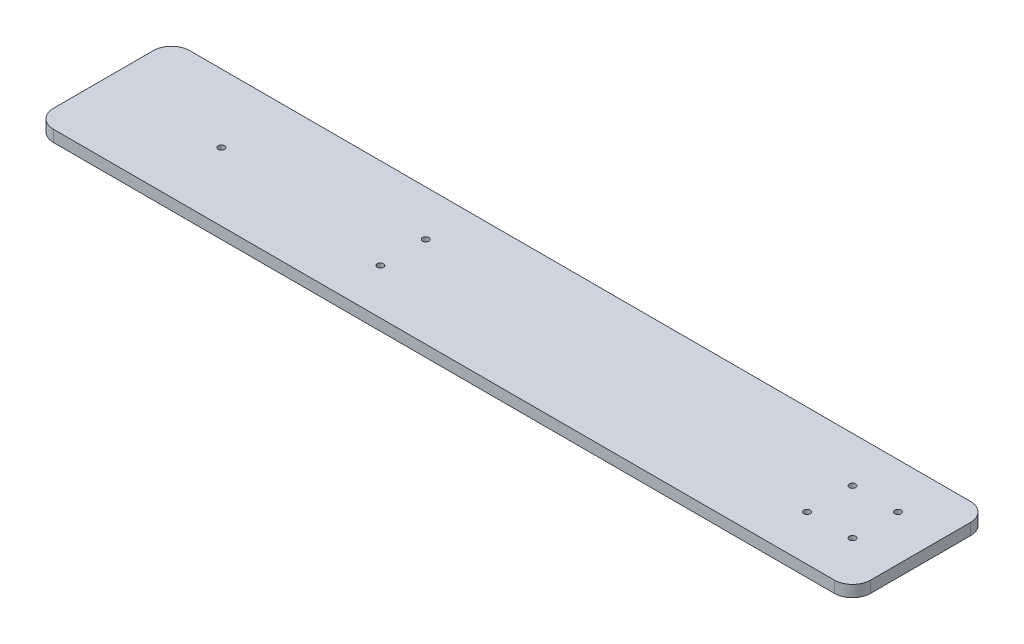
ISO-10303-21;
HEADER;
FILE_DESCRIPTION(('STEP AP214'),'2;1');
FILE_NAME('part.step','',(''),(''),'','','');
FILE_SCHEMA(('AUTOMOTIVE_DESIGN { 1 0 10303 214 1 1 1 1 }'));
ENDSEC;
DATA;
#1=APPLICATION_CONTEXT('core data for automotive mechanical design processes');
#2=APPLICATION_PROTOCOL_DEFINITION('international standard','automotive_design',2000,#1);
#3=PRODUCT_CONTEXT('',#1,'mechanical');
#4=PRODUCT('Part','Part','',(#3));
#5=PRODUCT_RELATED_PRODUCT_CATEGORY('part','',(#4));
#6=PRODUCT_DEFINITION_FORMATION('','',#4);
#7=PRODUCT_DEFINITION_CONTEXT('part definition',#1,'design');
#8=PRODUCT_DEFINITION('design','',#6,#7);
#9=PRODUCT_DEFINITION_SHAPE('','',#8);
#10=(LENGTH_UNIT() NAMED_UNIT(*) SI_UNIT(.MILLI.,.METRE.));
#11=(NAMED_UNIT(*) PLANE_ANGLE_UNIT() SI_UNIT($,.RADIAN.));
#12=(NAMED_UNIT(*) SI_UNIT($,.STERADIAN.) SOLID_ANGLE_UNIT());
#13=UNCERTAINTY_MEASURE_WITH_UNIT(LENGTH_MEASURE(1.E-05),#10,'distance_accuracy_value','');
#14=(GEOMETRIC_REPRESENTATION_CONTEXT(3) GLOBAL_UNCERTAINTY_ASSIGNED_CONTEXT((#13)) GLOBAL_UNIT_ASSIGNED_CONTEXT((#10,
#11,#12)) REPRESENTATION_CONTEXT('',''));
#15=CARTESIAN_POINT('',(0.,0.,0.));
#16=DIRECTION('',(0.,0.,1.));
#17=DIRECTION('',(1.,0.,0.));
#18=AXIS2_PLACEMENT_3D('',#15,#16,#17);
#19=CARTESIAN_POINT('',(225.,6.35,-37.5));
#20=DIRECTION('',(-1.,0.,0.));
#21=DIRECTION('',(0.,0.,1.));
#22=AXIS2_PLACEMENT_3D('',#19,#20,#21);
#23=PLANE('',#22);
#24=DIRECTION('',(0.,0.,-1.));
#25=VECTOR('',#24,1.);
#26=CARTESIAN_POINT('',(225.,0.,-37.5));
#27=LINE('',#26,#25);
#28=CARTESIAN_POINT('',(225.,0.,27.5));
#29=VERTEX_POINT('',#28);
#30=CARTESIAN_POINT('',(225.,0.,-27.5));
#31=VERTEX_POINT('',#30);
#32=EDGE_CURVE('E128',#29,#31,#27,.T.);
#33=ORIENTED_EDGE('',*,*,#32,.T.);
#34=DIRECTION('',(0.,-1.,0.));
#35=VECTOR('',#34,1.);
#36=CARTESIAN_POINT('',(225.,6.35,-27.5));
#37=LINE('',#36,#35);
#38=CARTESIAN_POINT('',(225.,6.35,-27.5));
#39=VERTEX_POINT('',#38);
#40=EDGE_CURVE('E106',#31,#39,#37,.F.);
#41=ORIENTED_EDGE('',*,*,#40,.T.);
#42=DIRECTION('',(0.,0.,-1.));
#43=VECTOR('',#42,1.);
#44=CARTESIAN_POINT('',(225.,6.35,-37.5));
#45=LINE('',#44,#43);
#46=CARTESIAN_POINT('',(225.,6.35,27.5));
#47=VERTEX_POINT('',#46);
#48=EDGE_CURVE('E138',#47,#39,#45,.T.);
#49=ORIENTED_EDGE('',*,*,#48,.F.);
#50=DIRECTION('',(0.,-1.,0.));
#51=VECTOR('',#50,1.);
#52=CARTESIAN_POINT('',(225.,6.35,27.5));
#53=LINE('',#52,#51);
#54=EDGE_CURVE('E111',#47,#29,#53,.T.);
#55=ORIENTED_EDGE('',*,*,#54,.T.);
#56=EDGE_LOOP('',(#33,#41,#49,#55));
#57=FACE_BOUND('',#56,.T.);
#58=ADVANCED_FACE('F35',(#57),#23,.F.);
#59=CARTESIAN_POINT('',(-225.,6.35,-37.5));
#60=DIRECTION('',(0.,0.,1.));
#61=DIRECTION('',(1.,0.,0.));
#62=AXIS2_PLACEMENT_3D('',#59,#60,#61);
#63=PLANE('',#62);
#64=DIRECTION('',(-1.,0.,0.));
#65=VECTOR('',#64,1.);
#66=CARTESIAN_POINT('',(-225.,6.35,-37.5));
#67=LINE('',#66,#65);
#68=CARTESIAN_POINT('',(215.,6.35,-37.5));
#69=VERTEX_POINT('',#68);
#70=CARTESIAN_POINT('',(-215.,6.35,-37.5));
#71=VERTEX_POINT('',#70);
#72=EDGE_CURVE('E121',#69,#71,#67,.T.);
#73=ORIENTED_EDGE('',*,*,#72,.F.);
#74=DIRECTION('',(0.,-1.,0.));
#75=VECTOR('',#74,1.);
#76=CARTESIAN_POINT('',(215.,6.35,-37.5));
#77=LINE('',#76,#75);
#78=CARTESIAN_POINT('',(215.,0.,-37.5));
#79=VERTEX_POINT('',#78);
#80=EDGE_CURVE('E105',#69,#79,#77,.T.);
#81=ORIENTED_EDGE('',*,*,#80,.T.);
#82=DIRECTION('',(-1.,0.,0.));
#83=VECTOR('',#82,1.);
#84=CARTESIAN_POINT('',(-225.,0.,-37.5));
#85=LINE('',#84,#83);
#86=CARTESIAN_POINT('',(-215.,0.,-37.5));
#87=VERTEX_POINT('',#86);
#88=EDGE_CURVE('E118',#79,#87,#85,.T.);
#89=ORIENTED_EDGE('',*,*,#88,.T.);
#90=DIRECTION('',(0.,-1.,0.));
#91=VECTOR('',#90,1.);
#92=CARTESIAN_POINT('',(-215.,6.35,-37.5));
#93=LINE('',#92,#91);
#94=EDGE_CURVE('E123',#87,#71,#93,.F.);
#95=ORIENTED_EDGE('',*,*,#94,.T.);
#96=EDGE_LOOP('',(#73,#81,#89,#95));
#97=FACE_BOUND('',#96,.T.);
#98=ADVANCED_FACE('F117',(#97),#63,.F.);
#99=CARTESIAN_POINT('',(-225.,6.35,-37.5));
#100=DIRECTION('',(1.,0.,0.));
#101=DIRECTION('',(0.,0.,-1.));
#102=AXIS2_PLACEMENT_3D('',#99,#100,#101);
#103=PLANE('',#102);
#104=DIRECTION('',(0.,0.,1.));
#105=VECTOR('',#104,1.);
#106=CARTESIAN_POINT('',(-225.,0.,-37.5));
#107=LINE('',#106,#105);
#108=CARTESIAN_POINT('',(-225.,0.,-27.5));
#109=VERTEX_POINT('',#108);
#110=CARTESIAN_POINT('',(-225.,0.,27.5));
#111=VERTEX_POINT('',#110);
#112=EDGE_CURVE('E127',#109,#111,#107,.T.);
#113=ORIENTED_EDGE('',*,*,#112,.T.);
#114=DIRECTION('',(0.,-1.,0.));
#115=VECTOR('',#114,1.);
#116=CARTESIAN_POINT('',(-225.,6.35,27.5));
#117=LINE('',#116,#115);
#118=CARTESIAN_POINT('',(-225.,6.35,27.5));
#119=VERTEX_POINT('',#118);
#120=EDGE_CURVE('E11',#111,#119,#117,.F.);
#121=ORIENTED_EDGE('',*,*,#120,.T.);
#122=DIRECTION('',(0.,0.,1.));
#123=VECTOR('',#122,1.);
#124=CARTESIAN_POINT('',(-225.,6.35,-37.5));
#125=LINE('',#124,#123);
#126=CARTESIAN_POINT('',(-225.,6.35,-27.5));
#127=VERTEX_POINT('',#126);
#128=EDGE_CURVE('E164',#127,#119,#125,.T.);
#129=ORIENTED_EDGE('',*,*,#128,.F.);
#130=DIRECTION('',(0.,-1.,0.));
#131=VECTOR('',#130,1.);
#132=CARTESIAN_POINT('',(-225.,6.35,-27.5));
#133=LINE('',#132,#131);
#134=EDGE_CURVE('E43',#127,#109,#133,.T.);
#135=ORIENTED_EDGE('',*,*,#134,.T.);
#136=EDGE_LOOP('',(#113,#121,#129,#135));
#137=FACE_BOUND('',#136,.T.);
#138=ADVANCED_FACE('F162',(#137),#103,.F.);
#139=CARTESIAN_POINT('',(-225.,6.35,37.5));
#140=DIRECTION('',(0.,0.,-1.));
#141=DIRECTION('',(-1.,0.,0.));
#142=AXIS2_PLACEMENT_3D('',#139,#140,#141);
#143=PLANE('',#142);
#144=DIRECTION('',(1.,0.,0.));
#145=VECTOR('',#144,1.);
#146=CARTESIAN_POINT('',(-225.,0.,37.5));
#147=LINE('',#146,#145);
#148=CARTESIAN_POINT('',(-215.,0.,37.5));
#149=VERTEX_POINT('',#148);
#150=CARTESIAN_POINT('',(215.,0.,37.5));
#151=VERTEX_POINT('',#150);
#152=EDGE_CURVE('E131',#149,#151,#147,.T.);
#153=ORIENTED_EDGE('',*,*,#152,.T.);
#154=DIRECTION('',(0.,-1.,0.));
#155=VECTOR('',#154,1.);
#156=CARTESIAN_POINT('',(215.,6.35,37.5));
#157=LINE('',#156,#155);
#158=CARTESIAN_POINT('',(215.,6.35,37.5));
#159=VERTEX_POINT('',#158);
#160=EDGE_CURVE('E50',#151,#159,#157,.F.);
#161=ORIENTED_EDGE('',*,*,#160,.T.);
#162=DIRECTION('',(1.,0.,0.));
#163=VECTOR('',#162,1.);
#164=CARTESIAN_POINT('',(-225.,6.35,37.5));
#165=LINE('',#164,#163);
#166=CARTESIAN_POINT('',(-215.,6.35,37.5));
#167=VERTEX_POINT('',#166);
#168=EDGE_CURVE('E139',#167,#159,#165,.T.);
#169=ORIENTED_EDGE('',*,*,#168,.F.);
#170=DIRECTION('',(0.,-1.,0.));
#171=VECTOR('',#170,1.);
#172=CARTESIAN_POINT('',(-215.,6.35,37.5));
#173=LINE('',#172,#171);
#174=EDGE_CURVE('E155',#167,#149,#173,.T.);
#175=ORIENTED_EDGE('',*,*,#174,.T.);
#176=EDGE_LOOP('',(#153,#161,#169,#175));
#177=FACE_BOUND('',#176,.T.);
#178=ADVANCED_FACE('F171',(#177),#143,.F.);
#179=CARTESIAN_POINT('',(0.,6.35,0.));
#180=DIRECTION('',(0.,1.,0.));
#181=DIRECTION('',(0.,0.,1.));
#182=AXIS2_PLACEMENT_3D('',#179,#180,#181);
#183=PLANE('',#182);
#184=CARTESIAN_POINT('',(-60.,6.35,12.5));
#185=DIRECTION('',(0.,1.,0.));
#186=DIRECTION('',(0.,0.,1.));
#187=AXIS2_PLACEMENT_3D('',#184,#185,#186);
#188=CIRCLE('',#187,1.75);
#189=CARTESIAN_POINT('',(-60.,6.35,14.25));
#190=VERTEX_POINT('',#189);
#191=EDGE_CURVE('E214',#190,#190,#188,.T.);
#192=ORIENTED_EDGE('',*,*,#191,.F.);
#193=EDGE_LOOP('',(#192));
#194=FACE_BOUND('',#193,.T.);
#195=CARTESIAN_POINT('',(-60.,6.35,-12.5));
#196=DIRECTION('',(0.,1.,0.));
#197=DIRECTION('',(0.,0.,1.));
#198=AXIS2_PLACEMENT_3D('',#195,#196,#197);
#199=CIRCLE('',#198,1.75);
#200=CARTESIAN_POINT('',(-60.,6.35,-10.75));
#201=VERTEX_POINT('',#200);
#202=EDGE_CURVE('E208',#201,#201,#199,.T.);
#203=ORIENTED_EDGE('',*,*,#202,.F.);
#204=EDGE_LOOP('',(#203));
#205=FACE_BOUND('',#204,.T.);
#206=CARTESIAN_POINT('',(-160.,6.35,0.));
#207=DIRECTION('',(0.,-1.,0.));
#208=DIRECTION('',(0.,0.,-1.));
#209=AXIS2_PLACEMENT_3D('',#206,#207,#208);
#210=CIRCLE('',#209,1.75000000000001);
#211=CARTESIAN_POINT('',(-160.,6.35,-1.75));
#212=VERTEX_POINT('',#211);
#213=EDGE_CURVE('E199',#212,#212,#210,.T.);
#214=ORIENTED_EDGE('',*,*,#213,.T.);
#215=EDGE_LOOP('',(#214));
#216=FACE_BOUND('',#215,.T.);
#217=CARTESIAN_POINT('',(200.,6.35,12.5));
#218=DIRECTION('',(0.,-1.,0.));
#219=DIRECTION('',(0.,0.,-1.));
#220=AXIS2_PLACEMENT_3D('',#217,#218,#219);
#221=CIRCLE('',#220,1.75000000000001);
#222=CARTESIAN_POINT('',(200.,6.35,10.75));
#223=VERTEX_POINT('',#222);
#224=EDGE_CURVE('E193',#223,#223,#221,.T.);
#225=ORIENTED_EDGE('',*,*,#224,.T.);
#226=EDGE_LOOP('',(#225));
#227=FACE_BOUND('',#226,.T.);
#228=CARTESIAN_POINT('',(175.,6.35,12.5));
#229=DIRECTION('',(0.,-1.,0.));
#230=DIRECTION('',(0.,0.,-1.));
#231=AXIS2_PLACEMENT_3D('',#228,#229,#230);
#232=CIRCLE('',#231,1.75000000000001);
#233=CARTESIAN_POINT('',(175.,6.35,10.75));
#234=VERTEX_POINT('',#233);
#235=EDGE_CURVE('E187',#234,#234,#232,.T.);
#236=ORIENTED_EDGE('',*,*,#235,.T.);
#237=EDGE_LOOP('',(#236));
#238=FACE_BOUND('',#237,.T.);
#239=CARTESIAN_POINT('',(200.,6.35,-12.5));
#240=DIRECTION('',(0.,-1.,0.));
#241=DIRECTION('',(0.,0.,-1.));
#242=AXIS2_PLACEMENT_3D('',#239,#240,#241);
#243=CIRCLE('',#242,1.75000000000001);
#244=CARTESIAN_POINT('',(200.,6.35,-14.25));
#245=VERTEX_POINT('',#244);
#246=EDGE_CURVE('E181',#245,#245,#243,.T.);
#247=ORIENTED_EDGE('',*,*,#246,.T.);
#248=EDGE_LOOP('',(#247));
#249=FACE_BOUND('',#248,.T.);
#250=CARTESIAN_POINT('',(175.,6.35,-12.5));
#251=DIRECTION('',(0.,-1.,0.));
#252=DIRECTION('',(0.,0.,-1.));
#253=AXIS2_PLACEMENT_3D('',#250,#251,#252);
#254=CIRCLE('',#253,1.75000000000001);
#255=CARTESIAN_POINT('',(175.,6.35,-14.25));
#256=VERTEX_POINT('',#255);
#257=EDGE_CURVE('E133',#256,#256,#254,.T.);
#258=ORIENTED_EDGE('',*,*,#257,.T.);
#259=EDGE_LOOP('',(#258));
#260=FACE_BOUND('',#259,.T.);
#261=ORIENTED_EDGE('',*,*,#48,.T.);
#262=CARTESIAN_POINT('',(215.,6.35,-27.5));
#263=DIRECTION('',(0.,1.,0.));
#264=DIRECTION('',(0.,0.,1.));
#265=AXIS2_PLACEMENT_3D('',#262,#263,#264);
#266=CIRCLE('',#265,10.);
#267=EDGE_CURVE('E153',#39,#69,#266,.T.);
#268=ORIENTED_EDGE('',*,*,#267,.T.);
#269=ORIENTED_EDGE('',*,*,#72,.T.);
#270=CARTESIAN_POINT('',(-215.,6.35,-27.5));
#271=DIRECTION('',(0.,1.,0.));
#272=DIRECTION('',(0.,0.,1.));
#273=AXIS2_PLACEMENT_3D('',#270,#271,#272);
#274=CIRCLE('',#273,10.);
#275=EDGE_CURVE('E148',#71,#127,#274,.T.);
#276=ORIENTED_EDGE('',*,*,#275,.T.);
#277=ORIENTED_EDGE('',*,*,#128,.T.);
#278=CARTESIAN_POINT('',(-215.,6.35,27.5));
#279=DIRECTION('',(0.,1.,0.));
#280=DIRECTION('',(0.,0.,1.));
#281=AXIS2_PLACEMENT_3D('',#278,#279,#280);
#282=CIRCLE('',#281,10.);
#283=EDGE_CURVE('E57',#119,#167,#282,.T.);
#284=ORIENTED_EDGE('',*,*,#283,.T.);
#285=ORIENTED_EDGE('',*,*,#168,.T.);
#286=CARTESIAN_POINT('',(215.,6.35,27.5));
#287=DIRECTION('',(0.,1.,0.));
#288=DIRECTION('',(0.,0.,1.));
#289=AXIS2_PLACEMENT_3D('',#286,#287,#288);
#290=CIRCLE('',#289,10.);
#291=EDGE_CURVE('E151',#159,#47,#290,.T.);
#292=ORIENTED_EDGE('',*,*,#291,.T.);
#293=EDGE_LOOP('',(#261,#268,#269,#276,#277,#284,#285,#292));
#294=FACE_BOUND('',#293,.T.);
#295=ADVANCED_FACE('F229',(#194,#205,#216,#227,#238,#249,#260,#294),#183,.T.);
#296=CARTESIAN_POINT('',(0.,0.,0.));
#297=DIRECTION('',(0.,1.,0.));
#298=DIRECTION('',(0.,0.,1.));
#299=AXIS2_PLACEMENT_3D('',#296,#297,#298);
#300=PLANE('',#299);
#301=CARTESIAN_POINT('',(-60.,0.,12.5));
#302=DIRECTION('',(0.,1.,0.));
#303=DIRECTION('',(0.,0.,1.));
#304=AXIS2_PLACEMENT_3D('',#301,#302,#303);
#305=CIRCLE('',#304,1.75);
#306=CARTESIAN_POINT('',(-60.,0.,14.25));
#307=VERTEX_POINT('',#306);
#308=EDGE_CURVE('E211',#307,#307,#305,.T.);
#309=ORIENTED_EDGE('',*,*,#308,.T.);
#310=EDGE_LOOP('',(#309));
#311=FACE_BOUND('',#310,.T.);
#312=CARTESIAN_POINT('',(-60.,0.,-12.5));
#313=DIRECTION('',(0.,1.,0.));
#314=DIRECTION('',(0.,0.,1.));
#315=AXIS2_PLACEMENT_3D('',#312,#313,#314);
#316=CIRCLE('',#315,1.75);
#317=CARTESIAN_POINT('',(-60.,0.,-10.75));
#318=VERTEX_POINT('',#317);
#319=EDGE_CURVE('E205',#318,#318,#316,.T.);
#320=ORIENTED_EDGE('',*,*,#319,.T.);
#321=EDGE_LOOP('',(#320));
#322=FACE_BOUND('',#321,.T.);
#323=CARTESIAN_POINT('',(-160.,0.,0.));
#324=DIRECTION('',(0.,-1.,0.));
#325=DIRECTION('',(0.,0.,-1.));
#326=AXIS2_PLACEMENT_3D('',#323,#324,#325);
#327=CIRCLE('',#326,1.75000000000001);
#328=CARTESIAN_POINT('',(-160.,0.,-1.75));
#329=VERTEX_POINT('',#328);
#330=EDGE_CURVE('E202',#329,#329,#327,.T.);
#331=ORIENTED_EDGE('',*,*,#330,.F.);
#332=EDGE_LOOP('',(#331));
#333=FACE_BOUND('',#332,.T.);
#334=CARTESIAN_POINT('',(200.,0.,12.5));
#335=DIRECTION('',(0.,-1.,0.));
#336=DIRECTION('',(0.,0.,-1.));
#337=AXIS2_PLACEMENT_3D('',#334,#335,#336);
#338=CIRCLE('',#337,1.75000000000001);
#339=CARTESIAN_POINT('',(200.,0.,10.75));
#340=VERTEX_POINT('',#339);
#341=EDGE_CURVE('E196',#340,#340,#338,.T.);
#342=ORIENTED_EDGE('',*,*,#341,.F.);
#343=EDGE_LOOP('',(#342));
#344=FACE_BOUND('',#343,.T.);
#345=CARTESIAN_POINT('',(175.,0.,12.5));
#346=DIRECTION('',(0.,-1.,0.));
#347=DIRECTION('',(0.,0.,-1.));
#348=AXIS2_PLACEMENT_3D('',#345,#346,#347);
#349=CIRCLE('',#348,1.75000000000001);
#350=CARTESIAN_POINT('',(175.,0.,10.75));
#351=VERTEX_POINT('',#350);
#352=EDGE_CURVE('E190',#351,#351,#349,.T.);
#353=ORIENTED_EDGE('',*,*,#352,.F.);
#354=EDGE_LOOP('',(#353));
#355=FACE_BOUND('',#354,.T.);
#356=CARTESIAN_POINT('',(200.,0.,-12.5));
#357=DIRECTION('',(0.,-1.,0.));
#358=DIRECTION('',(0.,0.,-1.));
#359=AXIS2_PLACEMENT_3D('',#356,#357,#358);
#360=CIRCLE('',#359,1.75000000000001);
#361=CARTESIAN_POINT('',(200.,0.,-14.25));
#362=VERTEX_POINT('',#361);
#363=EDGE_CURVE('E184',#362,#362,#360,.T.);
#364=ORIENTED_EDGE('',*,*,#363,.F.);
#365=EDGE_LOOP('',(#364));
#366=FACE_BOUND('',#365,.T.);
#367=CARTESIAN_POINT('',(175.,0.,-12.5));
#368=DIRECTION('',(0.,-1.,0.));
#369=DIRECTION('',(0.,0.,-1.));
#370=AXIS2_PLACEMENT_3D('',#367,#368,#369);
#371=CIRCLE('',#370,1.75000000000001);
#372=CARTESIAN_POINT('',(175.,0.,-14.25));
#373=VERTEX_POINT('',#372);
#374=EDGE_CURVE('E178',#373,#373,#371,.T.);
#375=ORIENTED_EDGE('',*,*,#374,.F.);
#376=EDGE_LOOP('',(#375));
#377=FACE_BOUND('',#376,.T.);
#378=ORIENTED_EDGE('',*,*,#88,.F.);
#379=CARTESIAN_POINT('',(215.,0.,-27.5));
#380=DIRECTION('',(0.,1.,0.));
#381=DIRECTION('',(0.,0.,1.));
#382=AXIS2_PLACEMENT_3D('',#379,#380,#381);
#383=CIRCLE('',#382,10.);
#384=EDGE_CURVE('E101',#79,#31,#383,.F.);
#385=ORIENTED_EDGE('',*,*,#384,.T.);
#386=ORIENTED_EDGE('',*,*,#32,.F.);
#387=CARTESIAN_POINT('',(215.,0.,27.5));
#388=DIRECTION('',(0.,1.,0.));
#389=DIRECTION('',(0.,0.,1.));
#390=AXIS2_PLACEMENT_3D('',#387,#388,#389);
#391=CIRCLE('',#390,10.);
#392=EDGE_CURVE('E112',#29,#151,#391,.F.);
#393=ORIENTED_EDGE('',*,*,#392,.T.);
#394=ORIENTED_EDGE('',*,*,#152,.F.);
#395=CARTESIAN_POINT('',(-215.,0.,27.5));
#396=DIRECTION('',(0.,1.,0.));
#397=DIRECTION('',(0.,0.,1.));
#398=AXIS2_PLACEMENT_3D('',#395,#396,#397);
#399=CIRCLE('',#398,10.);
#400=EDGE_CURVE('E142',#149,#111,#399,.F.);
#401=ORIENTED_EDGE('',*,*,#400,.T.);
#402=ORIENTED_EDGE('',*,*,#112,.F.);
#403=CARTESIAN_POINT('',(-215.,0.,-27.5));
#404=DIRECTION('',(0.,1.,0.));
#405=DIRECTION('',(0.,0.,1.));
#406=AXIS2_PLACEMENT_3D('',#403,#404,#405);
#407=CIRCLE('',#406,10.);
#408=EDGE_CURVE('E122',#109,#87,#407,.F.);
#409=ORIENTED_EDGE('',*,*,#408,.T.);
#410=EDGE_LOOP('',(#378,#385,#386,#393,#394,#401,#402,#409));
#411=FACE_BOUND('',#410,.T.);
#412=ADVANCED_FACE('F125',(#311,#322,#333,#344,#355,#366,#377,#411),#300,.F.);
#413=CARTESIAN_POINT('',(175.,6.35,-12.5));
#414=DIRECTION('',(0.,-1.,0.));
#415=DIRECTION('',(0.,0.,-1.));
#416=AXIS2_PLACEMENT_3D('',#413,#414,#415);
#417=CYLINDRICAL_SURFACE('',#416,1.75000000000001);
#418=ORIENTED_EDGE('',*,*,#257,.F.);
#419=EDGE_LOOP('',(#418));
#420=FACE_BOUND('',#419,.T.);
#421=ORIENTED_EDGE('',*,*,#374,.T.);
#422=EDGE_LOOP('',(#421));
#423=FACE_BOUND('',#422,.T.);
#424=ADVANCED_FACE('F269',(#420,#423),#417,.F.);
#425=CARTESIAN_POINT('',(200.,6.35,-12.5));
#426=DIRECTION('',(0.,-1.,0.));
#427=DIRECTION('',(0.,0.,-1.));
#428=AXIS2_PLACEMENT_3D('',#425,#426,#427);
#429=CYLINDRICAL_SURFACE('',#428,1.75000000000001);
#430=ORIENTED_EDGE('',*,*,#246,.F.);
#431=EDGE_LOOP('',(#430));
#432=FACE_BOUND('',#431,.T.);
#433=ORIENTED_EDGE('',*,*,#363,.T.);
#434=EDGE_LOOP('',(#433));
#435=FACE_BOUND('',#434,.T.);
#436=ADVANCED_FACE('F273',(#432,#435),#429,.F.);
#437=CARTESIAN_POINT('',(175.,6.35,12.5));
#438=DIRECTION('',(0.,-1.,0.));
#439=DIRECTION('',(0.,0.,-1.));
#440=AXIS2_PLACEMENT_3D('',#437,#438,#439);
#441=CYLINDRICAL_SURFACE('',#440,1.75000000000001);
#442=ORIENTED_EDGE('',*,*,#235,.F.);
#443=EDGE_LOOP('',(#442));
#444=FACE_BOUND('',#443,.T.);
#445=ORIENTED_EDGE('',*,*,#352,.T.);
#446=EDGE_LOOP('',(#445));
#447=FACE_BOUND('',#446,.T.);
#448=ADVANCED_FACE('F277',(#444,#447),#441,.F.);
#449=CARTESIAN_POINT('',(200.,6.35,12.5));
#450=DIRECTION('',(0.,-1.,0.));
#451=DIRECTION('',(0.,0.,-1.));
#452=AXIS2_PLACEMENT_3D('',#449,#450,#451);
#453=CYLINDRICAL_SURFACE('',#452,1.75000000000001);
#454=ORIENTED_EDGE('',*,*,#224,.F.);
#455=EDGE_LOOP('',(#454));
#456=FACE_BOUND('',#455,.T.);
#457=ORIENTED_EDGE('',*,*,#341,.T.);
#458=EDGE_LOOP('',(#457));
#459=FACE_BOUND('',#458,.T.);
#460=ADVANCED_FACE('F281',(#456,#459),#453,.F.);
#461=CARTESIAN_POINT('',(-160.,6.35,0.));
#462=DIRECTION('',(0.,-1.,0.));
#463=DIRECTION('',(0.,0.,-1.));
#464=AXIS2_PLACEMENT_3D('',#461,#462,#463);
#465=CYLINDRICAL_SURFACE('',#464,1.75000000000001);
#466=ORIENTED_EDGE('',*,*,#213,.F.);
#467=EDGE_LOOP('',(#466));
#468=FACE_BOUND('',#467,.T.);
#469=ORIENTED_EDGE('',*,*,#330,.T.);
#470=EDGE_LOOP('',(#469));
#471=FACE_BOUND('',#470,.T.);
#472=ADVANCED_FACE('F255',(#468,#471),#465,.F.);
#473=CARTESIAN_POINT('',(215.,6.35,-27.5));
#474=DIRECTION('',(0.,-1.,0.));
#475=DIRECTION('',(0.,0.,-1.));
#476=AXIS2_PLACEMENT_3D('',#473,#474,#475);
#477=CYLINDRICAL_SURFACE('',#476,10.);
#478=ORIENTED_EDGE('',*,*,#267,.F.);
#479=ORIENTED_EDGE('',*,*,#40,.F.);
#480=ORIENTED_EDGE('',*,*,#384,.F.);
#481=ORIENTED_EDGE('',*,*,#80,.F.);
#482=EDGE_LOOP('',(#478,#479,#480,#481));
#483=FACE_BOUND('',#482,.T.);
#484=ADVANCED_FACE('F104',(#483),#477,.T.);
#485=CARTESIAN_POINT('',(215.,6.35,27.5));
#486=DIRECTION('',(0.,-1.,0.));
#487=DIRECTION('',(0.,0.,-1.));
#488=AXIS2_PLACEMENT_3D('',#485,#486,#487);
#489=CYLINDRICAL_SURFACE('',#488,10.);
#490=ORIENTED_EDGE('',*,*,#291,.F.);
#491=ORIENTED_EDGE('',*,*,#160,.F.);
#492=ORIENTED_EDGE('',*,*,#392,.F.);
#493=ORIENTED_EDGE('',*,*,#54,.F.);
#494=EDGE_LOOP('',(#490,#491,#492,#493));
#495=FACE_BOUND('',#494,.T.);
#496=ADVANCED_FACE('F248',(#495),#489,.T.);
#497=CARTESIAN_POINT('',(-215.,6.35,27.5));
#498=DIRECTION('',(0.,-1.,0.));
#499=DIRECTION('',(0.,0.,-1.));
#500=AXIS2_PLACEMENT_3D('',#497,#498,#499);
#501=CYLINDRICAL_SURFACE('',#500,10.);
#502=ORIENTED_EDGE('',*,*,#283,.F.);
#503=ORIENTED_EDGE('',*,*,#120,.F.);
#504=ORIENTED_EDGE('',*,*,#400,.F.);
#505=ORIENTED_EDGE('',*,*,#174,.F.);
#506=EDGE_LOOP('',(#502,#503,#504,#505));
#507=FACE_BOUND('',#506,.T.);
#508=ADVANCED_FACE('F170',(#507),#501,.T.);
#509=CARTESIAN_POINT('',(-215.,6.35,-27.5));
#510=DIRECTION('',(0.,-1.,0.));
#511=DIRECTION('',(0.,0.,-1.));
#512=AXIS2_PLACEMENT_3D('',#509,#510,#511);
#513=CYLINDRICAL_SURFACE('',#512,10.);
#514=ORIENTED_EDGE('',*,*,#275,.F.);
#515=ORIENTED_EDGE('',*,*,#94,.F.);
#516=ORIENTED_EDGE('',*,*,#408,.F.);
#517=ORIENTED_EDGE('',*,*,#134,.F.);
#518=EDGE_LOOP('',(#514,#515,#516,#517));
#519=FACE_BOUND('',#518,.T.);
#520=ADVANCED_FACE('F37',(#519),#513,.T.);
#521=CARTESIAN_POINT('',(-60.,0.,-12.5));
#522=DIRECTION('',(0.,1.,0.));
#523=DIRECTION('',(0.,0.,1.));
#524=AXIS2_PLACEMENT_3D('',#521,#522,#523);
#525=CYLINDRICAL_SURFACE('',#524,1.75);
#526=ORIENTED_EDGE('',*,*,#319,.F.);
#527=EDGE_LOOP('',(#526));
#528=FACE_BOUND('',#527,.T.);
#529=ORIENTED_EDGE('',*,*,#202,.T.);
#530=EDGE_LOOP('',(#529));
#531=FACE_BOUND('',#530,.T.);
#532=ADVANCED_FACE('F225',(#528,#531),#525,.F.);
#533=CARTESIAN_POINT('',(-60.,0.,12.5));
#534=DIRECTION('',(0.,1.,0.));
#535=DIRECTION('',(0.,0.,1.));
#536=AXIS2_PLACEMENT_3D('',#533,#534,#535);
#537=CYLINDRICAL_SURFACE('',#536,1.75);
#538=ORIENTED_EDGE('',*,*,#308,.F.);
#539=EDGE_LOOP('',(#538));
#540=FACE_BOUND('',#539,.T.);
#541=ORIENTED_EDGE('',*,*,#191,.T.);
#542=EDGE_LOOP('',(#541));
#543=FACE_BOUND('',#542,.T.);
#544=ADVANCED_FACE('F222',(#540,#543),#537,.F.);
#545=CLOSED_SHELL('',(#58,#98,#138,#178,#295,#412,#424,#436,#448,#460,#472,#484,#496,#508,#520,
#532,#544));
#546=MANIFOLD_SOLID_BREP('B2',#545);
#547=ADVANCED_BREP_SHAPE_REPRESENTATION('',(#18,#546),#14);
#548=SHAPE_DEFINITION_REPRESENTATION(#9,#547);
ENDSEC;
END-ISO-10303-21;
